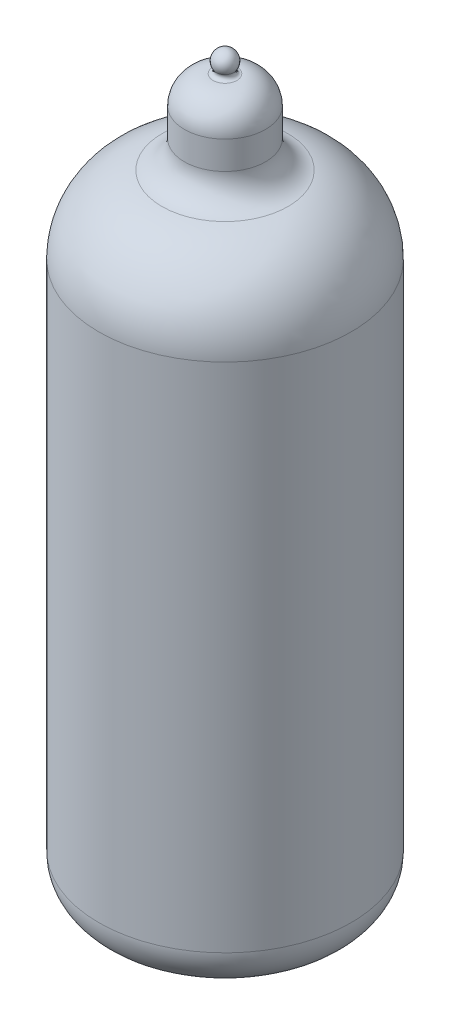
ISO-10303-21;
HEADER;
FILE_DESCRIPTION(('STEP AP214'),'2;1');
FILE_NAME('part.step','',(''),(''),'','','');
FILE_SCHEMA(('AUTOMOTIVE_DESIGN { 1 0 10303 214 1 1 1 1 }'));
ENDSEC;
DATA;
#1=APPLICATION_CONTEXT('core data for automotive mechanical design processes');
#2=APPLICATION_PROTOCOL_DEFINITION('international standard','automotive_design',2000,#1);
#3=PRODUCT_CONTEXT('',#1,'mechanical');
#4=PRODUCT('Part','Part','',(#3));
#5=PRODUCT_RELATED_PRODUCT_CATEGORY('part','',(#4));
#6=PRODUCT_DEFINITION_FORMATION('','',#4);
#7=PRODUCT_DEFINITION_CONTEXT('part definition',#1,'design');
#8=PRODUCT_DEFINITION('design','',#6,#7);
#9=PRODUCT_DEFINITION_SHAPE('','',#8);
#10=(LENGTH_UNIT() NAMED_UNIT(*) SI_UNIT(.MILLI.,.METRE.));
#11=(NAMED_UNIT(*) PLANE_ANGLE_UNIT() SI_UNIT($,.RADIAN.));
#12=(NAMED_UNIT(*) SI_UNIT($,.STERADIAN.) SOLID_ANGLE_UNIT());
#13=UNCERTAINTY_MEASURE_WITH_UNIT(LENGTH_MEASURE(1.E-05),#10,'distance_accuracy_value','');
#14=(GEOMETRIC_REPRESENTATION_CONTEXT(3) GLOBAL_UNCERTAINTY_ASSIGNED_CONTEXT((#13)) GLOBAL_UNIT_ASSIGNED_CONTEXT((#10,
#11,#12)) REPRESENTATION_CONTEXT('',''));
#15=CARTESIAN_POINT('',(0.,0.,0.));
#16=DIRECTION('',(0.,0.,1.));
#17=DIRECTION('',(1.,0.,0.));
#18=AXIS2_PLACEMENT_3D('',#15,#16,#17);
#19=CARTESIAN_POINT('',(-0.896039603960396,24.210396039604,0.));
#20=DIRECTION('',(0.,-1.,0.));
#21=DIRECTION('',(0.,0.,-1.));
#22=AXIS2_PLACEMENT_3D('',#19,#20,#21);
#23=PLANE('',#22);
#24=CARTESIAN_POINT('',(0.,24.210396039604,0.));
#25=DIRECTION('',(0.,1.,0.));
#26=DIRECTION('',(0.,0.,1.));
#27=AXIS2_PLACEMENT_3D('',#24,#25,#26);
#28=CIRCLE('',#27,0.896039603960402);
#29=CARTESIAN_POINT('',(0.,24.210396039604,0.896039603960402));
#30=VERTEX_POINT('',#29);
#31=EDGE_CURVE('E11',#30,#30,#28,.T.);
#32=ORIENTED_EDGE('',*,*,#31,.F.);
#33=EDGE_LOOP('',(#32));
#34=FACE_BOUND('',#33,.T.);
#35=ADVANCED_FACE('F38',(#34),#23,.T.);
#36=CARTESIAN_POINT('',(0.,22.710396039604,0.));
#37=DIRECTION('',(0.,1.,0.));
#38=DIRECTION('',(0.,0.,1.));
#39=AXIS2_PLACEMENT_3D('',#36,#37,#38);
#40=DEGENERATE_TOROIDAL_SURFACE('',#39,0.896039603960402,1.5,.T.);
#41=ORIENTED_EDGE('',*,*,#31,.T.);
#42=EDGE_LOOP('',(#41));
#43=FACE_BOUND('',#42,.T.);
#44=CARTESIAN_POINT('',(0.,22.710396039604,0.));
#45=DIRECTION('',(0.,1.,0.));
#46=DIRECTION('',(0.,0.,1.));
#47=AXIS2_PLACEMENT_3D('',#44,#45,#46);
#48=CIRCLE('',#47,2.3960396039604);
#49=CARTESIAN_POINT('',(0.,22.710396039604,2.3960396039604));
#50=VERTEX_POINT('',#49);
#51=EDGE_CURVE('E46',#50,#50,#48,.T.);
#52=ORIENTED_EDGE('',*,*,#51,.F.);
#53=EDGE_LOOP('',(#52));
#54=FACE_BOUND('',#53,.T.);
#55=ADVANCED_FACE('F314',(#43,#54),#40,.F.);
#56=CARTESIAN_POINT('',(0.,26.25,0.));
#57=DIRECTION('',(0.,1.,0.));
#58=DIRECTION('',(0.,0.,1.));
#59=AXIS2_PLACEMENT_3D('',#56,#57,#58);
#60=CYLINDRICAL_SURFACE('',#59,2.3960396039604);
#61=ORIENTED_EDGE('',*,*,#51,.T.);
#62=EDGE_LOOP('',(#61));
#63=FACE_BOUND('',#62,.T.);
#64=CARTESIAN_POINT('',(0.,20.710396039604,0.));
#65=DIRECTION('',(0.,1.,0.));
#66=DIRECTION('',(0.,0.,1.));
#67=AXIS2_PLACEMENT_3D('',#64,#65,#66);
#68=CIRCLE('',#67,2.3960396039604);
#69=CARTESIAN_POINT('',(0.,20.710396039604,2.3960396039604));
#70=VERTEX_POINT('',#69);
#71=EDGE_CURVE('E306',#70,#70,#68,.T.);
#72=ORIENTED_EDGE('',*,*,#71,.F.);
#73=EDGE_LOOP('',(#72));
#74=FACE_BOUND('',#73,.T.);
#75=ADVANCED_FACE('F311',(#63,#74),#60,.F.);
#76=CARTESIAN_POINT('',(0.,20.710396039604,0.));
#77=DIRECTION('',(0.,1.,0.));
#78=DIRECTION('',(0.,0.,1.));
#79=AXIS2_PLACEMENT_3D('',#76,#77,#78);
#80=TOROIDAL_SURFACE('',#79,4.8960396039604,2.5);
#81=ORIENTED_EDGE('',*,*,#71,.T.);
#82=EDGE_LOOP('',(#81));
#83=FACE_BOUND('',#82,.T.);
#84=CARTESIAN_POINT('',(0.,18.259900990099,0.));
#85=DIRECTION('',(0.,1.,0.));
#86=DIRECTION('',(0.,0.,1.));
#87=AXIS2_PLACEMENT_3D('',#84,#85,#86);
#88=CIRCLE('',#87,4.40099009900991);
#89=CARTESIAN_POINT('',(0.,18.259900990099,4.40099009900991));
#90=VERTEX_POINT('',#89);
#91=EDGE_CURVE('E303',#90,#90,#88,.T.);
#92=ORIENTED_EDGE('',*,*,#91,.F.);
#93=EDGE_LOOP('',(#92));
#94=FACE_BOUND('',#93,.T.);
#95=ADVANCED_FACE('F322',(#83,#94),#80,.T.);
#96=CARTESIAN_POINT('',(0.,13.25,0.));
#97=DIRECTION('',(0.,1.,0.));
#98=DIRECTION('',(0.,0.,1.));
#99=AXIS2_PLACEMENT_3D('',#96,#97,#98);
#100=DEGENERATE_TOROIDAL_SURFACE('',#99,3.38888888888889,5.11111111111111,.T.);
#101=ORIENTED_EDGE('',*,*,#91,.T.);
#102=EDGE_LOOP('',(#101));
#103=FACE_BOUND('',#102,.T.);
#104=CARTESIAN_POINT('',(0.,13.25,0.));
#105=DIRECTION('',(0.,1.,0.));
#106=DIRECTION('',(0.,0.,1.));
#107=AXIS2_PLACEMENT_3D('',#104,#105,#106);
#108=CIRCLE('',#107,8.5);
#109=CARTESIAN_POINT('',(0.,13.25,8.5));
#110=VERTEX_POINT('',#109);
#111=EDGE_CURVE('E300',#110,#110,#108,.T.);
#112=ORIENTED_EDGE('',*,*,#111,.F.);
#113=EDGE_LOOP('',(#112));
#114=FACE_BOUND('',#113,.T.);
#115=ADVANCED_FACE('F328',(#103,#114),#100,.F.);
#116=CARTESIAN_POINT('',(0.,26.25,0.));
#117=DIRECTION('',(0.,1.,0.));
#118=DIRECTION('',(0.,0.,1.));
#119=AXIS2_PLACEMENT_3D('',#116,#117,#118);
#120=CYLINDRICAL_SURFACE('',#119,8.5);
#121=ORIENTED_EDGE('',*,*,#111,.T.);
#122=EDGE_LOOP('',(#121));
#123=FACE_BOUND('',#122,.T.);
#124=CARTESIAN_POINT('',(0.,-21.25,0.));
#125=DIRECTION('',(0.,1.,0.));
#126=DIRECTION('',(0.,0.,1.));
#127=AXIS2_PLACEMENT_3D('',#124,#125,#126);
#128=CIRCLE('',#127,8.5);
#129=CARTESIAN_POINT('',(0.,-21.25,8.5));
#130=VERTEX_POINT('',#129);
#131=EDGE_CURVE('E297',#130,#130,#128,.T.);
#132=ORIENTED_EDGE('',*,*,#131,.F.);
#133=EDGE_LOOP('',(#132));
#134=FACE_BOUND('',#133,.T.);
#135=ADVANCED_FACE('F332',(#123,#134),#120,.F.);
#136=CARTESIAN_POINT('',(0.,-21.25,0.));
#137=DIRECTION('',(0.,1.,0.));
#138=DIRECTION('',(0.,0.,1.));
#139=AXIS2_PLACEMENT_3D('',#136,#137,#138);
#140=TOROIDAL_SURFACE('',#139,7.5,1.);
#141=ORIENTED_EDGE('',*,*,#131,.T.);
#142=EDGE_LOOP('',(#141));
#143=FACE_BOUND('',#142,.T.);
#144=CARTESIAN_POINT('',(0.,-22.25,0.));
#145=DIRECTION('',(0.,1.,0.));
#146=DIRECTION('',(0.,0.,1.));
#147=AXIS2_PLACEMENT_3D('',#144,#145,#146);
#148=CIRCLE('',#147,7.5);
#149=CARTESIAN_POINT('',(0.,-22.25,7.5));
#150=VERTEX_POINT('',#149);
#151=EDGE_CURVE('E293',#150,#150,#148,.T.);
#152=ORIENTED_EDGE('',*,*,#151,.F.);
#153=EDGE_LOOP('',(#152));
#154=FACE_BOUND('',#153,.T.);
#155=ADVANCED_FACE('F336',(#143,#154),#140,.F.);
#156=CARTESIAN_POINT('',(-7.49999999999999,-22.25,0.));
#157=DIRECTION('',(0.,1.,0.));
#158=DIRECTION('',(0.,0.,1.));
#159=AXIS2_PLACEMENT_3D('',#156,#157,#158);
#160=PLANE('',#159);
#161=CARTESIAN_POINT('',(2.67215823925168,-22.25,-5.09137214750595));
#162=DIRECTION('',(0.,1.,0.));
#163=DIRECTION('',(0.,0.,1.));
#164=AXIS2_PLACEMENT_3D('',#161,#162,#163);
#165=CIRCLE('',#164,0.25);
#166=CARTESIAN_POINT('',(2.67215823925168,-22.25,-4.84137214750595));
#167=VERTEX_POINT('',#166);
#168=EDGE_CURVE('E203',#167,#167,#165,.F.);
#169=ORIENTED_EDGE('',*,*,#168,.T.);
#170=EDGE_LOOP('',(#169));
#171=FACE_BOUND('',#170,.T.);
#172=CARTESIAN_POINT('',(4.73215722888853,-22.25,-3.26637229370414));
#173=DIRECTION('',(0.,1.,0.));
#174=DIRECTION('',(0.,0.,1.));
#175=AXIS2_PLACEMENT_3D('',#172,#173,#174);
#176=CIRCLE('',#175,0.25);
#177=CARTESIAN_POINT('',(4.73215722888853,-22.25,-3.01637229370414));
#178=VERTEX_POINT('',#177);
#179=EDGE_CURVE('E205',#178,#178,#176,.F.);
#180=ORIENTED_EDGE('',*,*,#179,.T.);
#181=EDGE_LOOP('',(#180));
#182=FACE_BOUND('',#181,.T.);
#183=CARTESIAN_POINT('',(5.70807602606381,-22.25,-0.693085911468095));
#184=DIRECTION('',(0.,1.,0.));
#185=DIRECTION('',(0.,0.,1.));
#186=AXIS2_PLACEMENT_3D('',#183,#184,#185);
#187=CIRCLE('',#186,0.25);
#188=CARTESIAN_POINT('',(5.70807602606381,-22.25,-0.443085911468095));
#189=VERTEX_POINT('',#188);
#190=EDGE_CURVE('E210',#189,#189,#187,.F.);
#191=ORIENTED_EDGE('',*,*,#190,.T.);
#192=EDGE_LOOP('',(#191));
#193=FACE_BOUND('',#192,.T.);
#194=CARTESIAN_POINT('',(5.37634339544113,-22.25,2.03897810049459));
#195=DIRECTION('',(0.,1.,0.));
#196=DIRECTION('',(0.,0.,1.));
#197=AXIS2_PLACEMENT_3D('',#194,#195,#196);
#198=CIRCLE('',#197,0.25);
#199=CARTESIAN_POINT('',(5.37634339544113,-22.25,2.28897810049459));
#200=VERTEX_POINT('',#199);
#201=EDGE_CURVE('E215',#200,#200,#198,.F.);
#202=ORIENTED_EDGE('',*,*,#201,.T.);
#203=EDGE_LOOP('',(#202));
#204=FACE_BOUND('',#203,.T.);
#205=CARTESIAN_POINT('',(3.81295528488456,-22.25,4.30393680198384));
#206=DIRECTION('',(0.,1.,0.));
#207=DIRECTION('',(0.,0.,1.));
#208=AXIS2_PLACEMENT_3D('',#205,#206,#207);
#209=CIRCLE('',#208,0.250000000000001);
#210=CARTESIAN_POINT('',(3.81295528488456,-22.25,4.55393680198384));
#211=VERTEX_POINT('',#210);
#212=EDGE_CURVE('E220',#211,#211,#209,.F.);
#213=ORIENTED_EDGE('',*,*,#212,.T.);
#214=EDGE_LOOP('',(#213));
#215=FACE_BOUND('',#214,.T.);
#216=CARTESIAN_POINT('',(1.37606506965345,-22.25,5.5829154501998));
#217=DIRECTION('',(0.,1.,0.));
#218=DIRECTION('',(0.,0.,1.));
#219=AXIS2_PLACEMENT_3D('',#216,#217,#218);
#220=CIRCLE('',#219,0.25);
#221=CARTESIAN_POINT('',(1.37606506965345,-22.25,5.8329154501998));
#222=VERTEX_POINT('',#221);
#223=EDGE_CURVE('E225',#222,#222,#220,.F.);
#224=ORIENTED_EDGE('',*,*,#223,.T.);
#225=EDGE_LOOP('',(#224));
#226=FACE_BOUND('',#225,.T.);
#227=CARTESIAN_POINT('',(-1.37606506965347,-22.25,5.5829154501998));
#228=DIRECTION('',(0.,1.,0.));
#229=DIRECTION('',(0.,0.,1.));
#230=AXIS2_PLACEMENT_3D('',#227,#228,#229);
#231=CIRCLE('',#230,0.25);
#232=CARTESIAN_POINT('',(-1.37606506965347,-22.25,5.8329154501998));
#233=VERTEX_POINT('',#232);
#234=EDGE_CURVE('E230',#233,#233,#231,.F.);
#235=ORIENTED_EDGE('',*,*,#234,.T.);
#236=EDGE_LOOP('',(#235));
#237=FACE_BOUND('',#236,.T.);
#238=CARTESIAN_POINT('',(-3.81295528488458,-22.25,4.30393680198382));
#239=DIRECTION('',(0.,1.,0.));
#240=DIRECTION('',(0.,0.,1.));
#241=AXIS2_PLACEMENT_3D('',#238,#239,#240);
#242=CIRCLE('',#241,0.25);
#243=CARTESIAN_POINT('',(-3.81295528488458,-22.25,4.55393680198382));
#244=VERTEX_POINT('',#243);
#245=EDGE_CURVE('E235',#244,#244,#242,.F.);
#246=ORIENTED_EDGE('',*,*,#245,.T.);
#247=EDGE_LOOP('',(#246));
#248=FACE_BOUND('',#247,.T.);
#249=CARTESIAN_POINT('',(-5.37634339544114,-22.25,2.03897810049457));
#250=DIRECTION('',(0.,1.,0.));
#251=DIRECTION('',(0.,0.,1.));
#252=AXIS2_PLACEMENT_3D('',#249,#250,#251);
#253=CIRCLE('',#252,0.25);
#254=CARTESIAN_POINT('',(-5.37634339544114,-22.25,2.28897810049457));
#255=VERTEX_POINT('',#254);
#256=EDGE_CURVE('E240',#255,#255,#253,.F.);
#257=ORIENTED_EDGE('',*,*,#256,.T.);
#258=EDGE_LOOP('',(#257));
#259=FACE_BOUND('',#258,.T.);
#260=CARTESIAN_POINT('',(-5.70807602606381,-22.25,-0.693085911468117));
#261=DIRECTION('',(0.,1.,0.));
#262=DIRECTION('',(0.,0.,1.));
#263=AXIS2_PLACEMENT_3D('',#260,#261,#262);
#264=CIRCLE('',#263,0.25);
#265=CARTESIAN_POINT('',(-5.70807602606381,-22.25,-0.443085911468116));
#266=VERTEX_POINT('',#265);
#267=EDGE_CURVE('E245',#266,#266,#264,.F.);
#268=ORIENTED_EDGE('',*,*,#267,.T.);
#269=EDGE_LOOP('',(#268));
#270=FACE_BOUND('',#269,.T.);
#271=CARTESIAN_POINT('',(-4.73215722888852,-22.25,-3.26637229370415));
#272=DIRECTION('',(0.,1.,0.));
#273=DIRECTION('',(0.,0.,1.));
#274=AXIS2_PLACEMENT_3D('',#271,#272,#273);
#275=CIRCLE('',#274,0.250000000000001);
#276=CARTESIAN_POINT('',(-4.73215722888852,-22.25,-3.01637229370415));
#277=VERTEX_POINT('',#276);
#278=EDGE_CURVE('E250',#277,#277,#275,.F.);
#279=ORIENTED_EDGE('',*,*,#278,.T.);
#280=EDGE_LOOP('',(#279));
#281=FACE_BOUND('',#280,.T.);
#282=CARTESIAN_POINT('',(-2.67215823925166,-22.25,-5.09137214750596));
#283=DIRECTION('',(0.,1.,0.));
#284=DIRECTION('',(0.,0.,1.));
#285=AXIS2_PLACEMENT_3D('',#282,#283,#284);
#286=CIRCLE('',#285,0.25);
#287=CARTESIAN_POINT('',(-2.67215823925166,-22.25,-4.84137214750596));
#288=VERTEX_POINT('',#287);
#289=EDGE_CURVE('E255',#288,#288,#286,.F.);
#290=ORIENTED_EDGE('',*,*,#289,.T.);
#291=EDGE_LOOP('',(#290));
#292=FACE_BOUND('',#291,.T.);
#293=CARTESIAN_POINT('',(0.,-22.25,-5.75));
#294=DIRECTION('',(0.,1.,0.));
#295=DIRECTION('',(0.,0.,1.));
#296=AXIS2_PLACEMENT_3D('',#293,#294,#295);
#297=CIRCLE('',#296,0.25);
#298=CARTESIAN_POINT('',(0.,-22.25,-5.5));
#299=VERTEX_POINT('',#298);
#300=EDGE_CURVE('E260',#299,#299,#297,.F.);
#301=ORIENTED_EDGE('',*,*,#300,.T.);
#302=EDGE_LOOP('',(#301));
#303=FACE_BOUND('',#302,.T.);
#304=ORIENTED_EDGE('',*,*,#151,.T.);
#305=EDGE_LOOP('',(#304));
#306=FACE_BOUND('',#305,.T.);
#307=ADVANCED_FACE('F340',(#171,#182,#193,#204,#215,#226,#237,#248,#259,#270,#281,#292,#303,
#306),#160,.T.);
#308=CARTESIAN_POINT('',(0.,26.251,-5.75));
#309=DIRECTION('',(0.,-1.,0.));
#310=DIRECTION('',(0.,0.,-1.));
#311=AXIS2_PLACEMENT_3D('',#308,#309,#310);
#312=CYLINDRICAL_SURFACE('',#311,0.25);
#313=ORIENTED_EDGE('',*,*,#300,.F.);
#314=EDGE_LOOP('',(#313));
#315=FACE_BOUND('',#314,.T.);
#316=CARTESIAN_POINT('',(0.,-26.25,-5.75));
#317=DIRECTION('',(0.,-1.,0.));
#318=DIRECTION('',(0.,0.,-1.));
#319=AXIS2_PLACEMENT_3D('',#316,#317,#318);
#320=CIRCLE('',#319,0.25);
#321=CARTESIAN_POINT('',(0.,-26.25,-6.));
#322=VERTEX_POINT('',#321);
#323=EDGE_CURVE('E263',#322,#322,#320,.T.);
#324=ORIENTED_EDGE('',*,*,#323,.T.);
#325=EDGE_LOOP('',(#324));
#326=FACE_BOUND('',#325,.T.);
#327=ADVANCED_FACE('F344',(#315,#326),#312,.F.);
#328=CARTESIAN_POINT('',(0.,25.5,0.));
#329=DIRECTION('',(0.,1.,0.));
#330=DIRECTION('',(1.,0.,0.));
#331=AXIS2_PLACEMENT_3D('',#328,#329,#330);
#332=SPHERICAL_SURFACE('',#331,0.750000000000001);
#333=CARTESIAN_POINT('',(0.,25.0948011010718,0.));
#334=DIRECTION('',(0.,1.,0.));
#335=DIRECTION('',(0.,0.,1.));
#336=AXIS2_PLACEMENT_3D('',#333,#334,#335);
#337=CIRCLE('',#336,0.631121107480484);
#338=CARTESIAN_POINT('',(0.,25.0948011010718,0.631121107480484));
#339=VERTEX_POINT('',#338);
#340=EDGE_CURVE('E266',#339,#339,#337,.T.);
#341=ORIENTED_EDGE('',*,*,#340,.T.);
#342=EDGE_LOOP('',(#341));
#343=FACE_BOUND('',#342,.T.);
#344=ADVANCED_FACE('F40',(#343),#332,.T.);
#345=CARTESIAN_POINT('',(0.,-26.25,0.));
#346=DIRECTION('',(0.,-1.,0.));
#347=DIRECTION('',(0.,0.,-1.));
#348=AXIS2_PLACEMENT_3D('',#345,#346,#347);
#349=PLANE('',#348);
#350=CARTESIAN_POINT('',(0.,-26.25,0.));
#351=DIRECTION('',(0.,-1.,0.));
#352=DIRECTION('',(0.,0.,-1.));
#353=AXIS2_PLACEMENT_3D('',#350,#351,#352);
#354=CIRCLE('',#353,3.);
#355=CARTESIAN_POINT('',(0.,-26.25,-3.));
#356=VERTEX_POINT('',#355);
#357=EDGE_CURVE('E170',#356,#356,#354,.T.);
#358=ORIENTED_EDGE('',*,*,#357,.F.);
#359=EDGE_LOOP('',(#358));
#360=FACE_BOUND('',#359,.T.);
#361=CARTESIAN_POINT('',(0.,-26.25,0.));
#362=DIRECTION('',(0.,1.,0.));
#363=DIRECTION('',(0.,0.,1.));
#364=AXIS2_PLACEMENT_3D('',#361,#362,#363);
#365=CIRCLE('',#364,6.);
#366=CARTESIAN_POINT('',(2.78833903226262,-26.25,-5.31273615391926));
#367=VERTEX_POINT('',#366);
#368=EDGE_CURVE('E289',#367,#322,#365,.T.);
#369=ORIENTED_EDGE('',*,*,#368,.F.);
#370=CARTESIAN_POINT('',(2.67215823925168,-26.25,-5.09137214750595));
#371=DIRECTION('',(0.,-1.,0.));
#372=DIRECTION('',(0.,0.,-1.));
#373=AXIS2_PLACEMENT_3D('',#370,#371,#372);
#374=CIRCLE('',#373,0.25);
#375=EDGE_CURVE('E59',#367,#367,#374,.T.);
#376=ORIENTED_EDGE('',*,*,#375,.F.);
#377=CARTESIAN_POINT('',(4.93790319536195,-26.25,-3.40838848038693));
#378=VERTEX_POINT('',#377);
#379=EDGE_CURVE('E475',#378,#367,#365,.T.);
#380=ORIENTED_EDGE('',*,*,#379,.F.);
#381=CARTESIAN_POINT('',(4.73215722888853,-26.25,-3.26637229370414));
#382=DIRECTION('',(0.,-1.,0.));
#383=DIRECTION('',(0.,0.,-1.));
#384=AXIS2_PLACEMENT_3D('',#381,#382,#383);
#385=CIRCLE('',#384,0.25);
#386=EDGE_CURVE('E208',#378,#378,#385,.T.);
#387=ORIENTED_EDGE('',*,*,#386,.F.);
#388=CARTESIAN_POINT('',(5.95625324458833,-26.25,-0.723220081531926));
#389=VERTEX_POINT('',#388);
#390=EDGE_CURVE('E480',#389,#378,#365,.T.);
#391=ORIENTED_EDGE('',*,*,#390,.F.);
#392=CARTESIAN_POINT('',(5.70807602606381,-26.25,-0.693085911468095));
#393=DIRECTION('',(0.,-1.,0.));
#394=DIRECTION('',(0.,0.,-1.));
#395=AXIS2_PLACEMENT_3D('',#392,#393,#394);
#396=CIRCLE('',#395,0.25);
#397=EDGE_CURVE('E213',#389,#389,#396,.T.);
#398=ORIENTED_EDGE('',*,*,#397,.F.);
#399=CARTESIAN_POINT('',(5.61009745611249,-26.25,2.12762932225523));
#400=VERTEX_POINT('',#399);
#401=EDGE_CURVE('E482',#400,#389,#365,.T.);
#402=ORIENTED_EDGE('',*,*,#401,.F.);
#403=CARTESIAN_POINT('',(5.37634339544113,-26.25,2.03897810049459));
#404=DIRECTION('',(0.,-1.,0.));
#405=DIRECTION('',(0.,0.,-1.));
#406=AXIS2_PLACEMENT_3D('',#403,#404,#405);
#407=CIRCLE('',#406,0.25);
#408=EDGE_CURVE('E218',#400,#400,#407,.T.);
#409=ORIENTED_EDGE('',*,*,#408,.F.);
#410=CARTESIAN_POINT('',(3.97873594944477,-26.25,4.49106448902662));
#411=VERTEX_POINT('',#410);
#412=EDGE_CURVE('E483',#411,#400,#365,.T.);
#413=ORIENTED_EDGE('',*,*,#412,.F.);
#414=CARTESIAN_POINT('',(3.81295528488456,-26.25,4.30393680198384));
#415=DIRECTION('',(0.,-1.,0.));
#416=DIRECTION('',(0.,0.,-1.));
#417=AXIS2_PLACEMENT_3D('',#414,#415,#416);
#418=CIRCLE('',#417,0.250000000000001);
#419=EDGE_CURVE('E223',#411,#411,#418,.T.);
#420=ORIENTED_EDGE('',*,*,#419,.F.);
#421=CARTESIAN_POINT('',(1.43589398572534,-26.25,5.82565090455632));
#422=VERTEX_POINT('',#421);
#423=EDGE_CURVE('E486',#422,#411,#365,.T.);
#424=ORIENTED_EDGE('',*,*,#423,.F.);
#425=CARTESIAN_POINT('',(1.37606506965345,-26.25,5.5829154501998));
#426=DIRECTION('',(0.,-1.,0.));
#427=DIRECTION('',(0.,0.,-1.));
#428=AXIS2_PLACEMENT_3D('',#425,#426,#427);
#429=CIRCLE('',#428,0.25);
#430=EDGE_CURVE('E228',#422,#422,#429,.T.);
#431=ORIENTED_EDGE('',*,*,#430,.F.);
#432=CARTESIAN_POINT('',(-1.43589398572536,-26.25,5.82565090455631));
#433=VERTEX_POINT('',#432);
#434=EDGE_CURVE('E489',#433,#422,#365,.T.);
#435=ORIENTED_EDGE('',*,*,#434,.F.);
#436=CARTESIAN_POINT('',(-1.37606506965347,-26.25,5.5829154501998));
#437=DIRECTION('',(0.,-1.,0.));
#438=DIRECTION('',(0.,0.,-1.));
#439=AXIS2_PLACEMENT_3D('',#436,#437,#438);
#440=CIRCLE('',#439,0.25);
#441=EDGE_CURVE('E233',#433,#433,#440,.T.);
#442=ORIENTED_EDGE('',*,*,#441,.F.);
#443=CARTESIAN_POINT('',(-3.97873594944478,-26.25,4.4910644890266));
#444=VERTEX_POINT('',#443);
#445=EDGE_CURVE('E492',#444,#433,#365,.T.);
#446=ORIENTED_EDGE('',*,*,#445,.F.);
#447=CARTESIAN_POINT('',(-3.81295528488458,-26.25,4.30393680198382));
#448=DIRECTION('',(0.,-1.,0.));
#449=DIRECTION('',(0.,0.,-1.));
#450=AXIS2_PLACEMENT_3D('',#447,#448,#449);
#451=CIRCLE('',#450,0.25);
#452=EDGE_CURVE('E238',#444,#444,#451,.T.);
#453=ORIENTED_EDGE('',*,*,#452,.F.);
#454=CARTESIAN_POINT('',(-5.61009745611249,-26.25,2.1276293222552));
#455=VERTEX_POINT('',#454);
#456=EDGE_CURVE('E495',#455,#444,#365,.T.);
#457=ORIENTED_EDGE('',*,*,#456,.F.);
#458=CARTESIAN_POINT('',(-5.37634339544114,-26.25,2.03897810049457));
#459=DIRECTION('',(0.,-1.,0.));
#460=DIRECTION('',(0.,0.,-1.));
#461=AXIS2_PLACEMENT_3D('',#458,#459,#460);
#462=CIRCLE('',#461,0.25);
#463=EDGE_CURVE('E243',#455,#455,#462,.T.);
#464=ORIENTED_EDGE('',*,*,#463,.F.);
#465=CARTESIAN_POINT('',(-5.95625324458832,-26.25,-0.723220081531947));
#466=VERTEX_POINT('',#465);
#467=EDGE_CURVE('E498',#466,#455,#365,.T.);
#468=ORIENTED_EDGE('',*,*,#467,.F.);
#469=CARTESIAN_POINT('',(-5.70807602606381,-26.25,-0.693085911468117));
#470=DIRECTION('',(0.,-1.,0.));
#471=DIRECTION('',(0.,0.,-1.));
#472=AXIS2_PLACEMENT_3D('',#469,#470,#471);
#473=CIRCLE('',#472,0.25);
#474=EDGE_CURVE('E248',#466,#466,#473,.T.);
#475=ORIENTED_EDGE('',*,*,#474,.F.);
#476=CARTESIAN_POINT('',(-4.93790319536193,-26.25,-3.40838848038694));
#477=VERTEX_POINT('',#476);
#478=EDGE_CURVE('E501',#477,#466,#365,.T.);
#479=ORIENTED_EDGE('',*,*,#478,.F.);
#480=CARTESIAN_POINT('',(-4.73215722888852,-26.25,-3.26637229370415));
#481=DIRECTION('',(0.,-1.,0.));
#482=DIRECTION('',(0.,0.,-1.));
#483=AXIS2_PLACEMENT_3D('',#480,#481,#482);
#484=CIRCLE('',#483,0.250000000000001);
#485=EDGE_CURVE('E253',#477,#477,#484,.T.);
#486=ORIENTED_EDGE('',*,*,#485,.F.);
#487=CARTESIAN_POINT('',(-2.7883390322626,-26.25,-5.31273615391926));
#488=VERTEX_POINT('',#487);
#489=EDGE_CURVE('E294',#488,#477,#365,.T.);
#490=ORIENTED_EDGE('',*,*,#489,.F.);
#491=CARTESIAN_POINT('',(-2.67215823925166,-26.25,-5.09137214750596));
#492=DIRECTION('',(0.,-1.,0.));
#493=DIRECTION('',(0.,0.,-1.));
#494=AXIS2_PLACEMENT_3D('',#491,#492,#493);
#495=CIRCLE('',#494,0.25);
#496=EDGE_CURVE('E258',#488,#488,#495,.T.);
#497=ORIENTED_EDGE('',*,*,#496,.F.);
#498=EDGE_CURVE('E290',#322,#488,#365,.T.);
#499=ORIENTED_EDGE('',*,*,#498,.F.);
#500=ORIENTED_EDGE('',*,*,#323,.F.);
#501=EDGE_LOOP('',(#369,#376,#380,#387,#391,#398,#402,#409,#413,#420,#424,#431,#435,#442,#446,
#453,#457,#464,#468,#475,#479,#486,#490,#497,#499,#500));
#502=FACE_BOUND('',#501,.T.);
#503=ADVANCED_FACE('F346',(#360,#502),#349,.T.);
#504=CARTESIAN_POINT('',(0.,-23.25,0.));
#505=DIRECTION('',(0.,1.,0.));
#506=DIRECTION('',(0.,0.,1.));
#507=AXIS2_PLACEMENT_3D('',#504,#505,#506);
#508=TOROIDAL_SURFACE('',#507,6.,3.);
#509=ORIENTED_EDGE('',*,*,#498,.T.);
#510=ORIENTED_EDGE('',*,*,#489,.T.);
#511=ORIENTED_EDGE('',*,*,#478,.T.);
#512=ORIENTED_EDGE('',*,*,#467,.T.);
#513=ORIENTED_EDGE('',*,*,#456,.T.);
#514=ORIENTED_EDGE('',*,*,#445,.T.);
#515=ORIENTED_EDGE('',*,*,#434,.T.);
#516=ORIENTED_EDGE('',*,*,#423,.T.);
#517=ORIENTED_EDGE('',*,*,#412,.T.);
#518=ORIENTED_EDGE('',*,*,#401,.T.);
#519=ORIENTED_EDGE('',*,*,#390,.T.);
#520=ORIENTED_EDGE('',*,*,#379,.T.);
#521=ORIENTED_EDGE('',*,*,#368,.T.);
#522=EDGE_LOOP('',(#509,#510,#511,#512,#513,#514,#515,#516,#517,#518,#519,#520,#521));
#523=FACE_BOUND('',#522,.T.);
#524=CARTESIAN_POINT('',(0.,-23.25,0.));
#525=DIRECTION('',(0.,1.,0.));
#526=DIRECTION('',(0.,0.,1.));
#527=AXIS2_PLACEMENT_3D('',#524,#525,#526);
#528=CIRCLE('',#527,9.);
#529=CARTESIAN_POINT('',(0.,-23.25,9.));
#530=VERTEX_POINT('',#529);
#531=EDGE_CURVE('E286',#530,#530,#528,.T.);
#532=ORIENTED_EDGE('',*,*,#531,.F.);
#533=EDGE_LOOP('',(#532));
#534=FACE_BOUND('',#533,.T.);
#535=ADVANCED_FACE('F349',(#523,#534),#508,.T.);
#536=CARTESIAN_POINT('',(0.,26.25,0.));
#537=DIRECTION('',(0.,1.,0.));
#538=DIRECTION('',(0.,0.,1.));
#539=AXIS2_PLACEMENT_3D('',#536,#537,#538);
#540=CYLINDRICAL_SURFACE('',#539,9.);
#541=ORIENTED_EDGE('',*,*,#531,.T.);
#542=EDGE_LOOP('',(#541));
#543=FACE_BOUND('',#542,.T.);
#544=CARTESIAN_POINT('',(0.,13.25,0.));
#545=DIRECTION('',(0.,1.,0.));
#546=DIRECTION('',(0.,0.,1.));
#547=AXIS2_PLACEMENT_3D('',#544,#545,#546);
#548=CIRCLE('',#547,9.);
#549=CARTESIAN_POINT('',(0.,13.25,9.));
#550=VERTEX_POINT('',#549);
#551=EDGE_CURVE('E283',#550,#550,#548,.T.);
#552=ORIENTED_EDGE('',*,*,#551,.F.);
#553=EDGE_LOOP('',(#552));
#554=FACE_BOUND('',#553,.T.);
#555=ADVANCED_FACE('F353',(#543,#554),#540,.T.);
#556=CARTESIAN_POINT('',(0.,13.25,0.));
#557=DIRECTION('',(0.,1.,0.));
#558=DIRECTION('',(0.,0.,1.));
#559=AXIS2_PLACEMENT_3D('',#556,#557,#558);
#560=DEGENERATE_TOROIDAL_SURFACE('',#559,3.38888888888889,5.61111111111111,.T.);
#561=ORIENTED_EDGE('',*,*,#551,.T.);
#562=EDGE_LOOP('',(#561));
#563=FACE_BOUND('',#562,.T.);
#564=CARTESIAN_POINT('',(0.,18.75,0.));
#565=DIRECTION('',(0.,1.,0.));
#566=DIRECTION('',(0.,0.,1.));
#567=AXIS2_PLACEMENT_3D('',#564,#565,#566);
#568=CIRCLE('',#567,4.5);
#569=CARTESIAN_POINT('',(0.,18.75,4.5));
#570=VERTEX_POINT('',#569);
#571=EDGE_CURVE('E280',#570,#570,#568,.T.);
#572=ORIENTED_EDGE('',*,*,#571,.F.);
#573=EDGE_LOOP('',(#572));
#574=FACE_BOUND('',#573,.T.);
#575=ADVANCED_FACE('F357',(#563,#574),#560,.T.);
#576=CARTESIAN_POINT('',(0.,20.710396039604,0.));
#577=DIRECTION('',(0.,1.,0.));
#578=DIRECTION('',(0.,0.,1.));
#579=AXIS2_PLACEMENT_3D('',#576,#577,#578);
#580=TOROIDAL_SURFACE('',#579,4.8960396039604,2.);
#581=ORIENTED_EDGE('',*,*,#571,.T.);
#582=EDGE_LOOP('',(#581));
#583=FACE_BOUND('',#582,.T.);
#584=CARTESIAN_POINT('',(0.,20.710396039604,0.));
#585=DIRECTION('',(0.,1.,0.));
#586=DIRECTION('',(0.,0.,1.));
#587=AXIS2_PLACEMENT_3D('',#584,#585,#586);
#588=CIRCLE('',#587,2.8960396039604);
#589=CARTESIAN_POINT('',(0.,20.710396039604,2.8960396039604));
#590=VERTEX_POINT('',#589);
#591=EDGE_CURVE('E277',#590,#590,#588,.T.);
#592=ORIENTED_EDGE('',*,*,#591,.F.);
#593=EDGE_LOOP('',(#592));
#594=FACE_BOUND('',#593,.T.);
#595=ADVANCED_FACE('F361',(#583,#594),#580,.F.);
#596=CARTESIAN_POINT('',(0.,26.25,0.));
#597=DIRECTION('',(0.,1.,0.));
#598=DIRECTION('',(0.,0.,1.));
#599=AXIS2_PLACEMENT_3D('',#596,#597,#598);
#600=CYLINDRICAL_SURFACE('',#599,2.8960396039604);
#601=ORIENTED_EDGE('',*,*,#591,.T.);
#602=EDGE_LOOP('',(#601));
#603=FACE_BOUND('',#602,.T.);
#604=CARTESIAN_POINT('',(0.,22.710396039604,0.));
#605=DIRECTION('',(0.,1.,0.));
#606=DIRECTION('',(0.,0.,1.));
#607=AXIS2_PLACEMENT_3D('',#604,#605,#606);
#608=CIRCLE('',#607,2.8960396039604);
#609=CARTESIAN_POINT('',(0.,22.710396039604,2.8960396039604));
#610=VERTEX_POINT('',#609);
#611=EDGE_CURVE('E274',#610,#610,#608,.T.);
#612=ORIENTED_EDGE('',*,*,#611,.F.);
#613=EDGE_LOOP('',(#612));
#614=FACE_BOUND('',#613,.T.);
#615=ADVANCED_FACE('F365',(#603,#614),#600,.T.);
#616=CARTESIAN_POINT('',(0.,22.710396039604,0.));
#617=DIRECTION('',(0.,1.,0.));
#618=DIRECTION('',(0.,0.,1.));
#619=AXIS2_PLACEMENT_3D('',#616,#617,#618);
#620=DEGENERATE_TOROIDAL_SURFACE('',#619,0.896039603960402,2.,.T.);
#621=ORIENTED_EDGE('',*,*,#611,.T.);
#622=EDGE_LOOP('',(#621));
#623=FACE_BOUND('',#622,.T.);
#624=CARTESIAN_POINT('',(0.,24.7098082723374,0.));
#625=DIRECTION('',(0.,1.,0.));
#626=DIRECTION('',(0.,0.,1.));
#627=AXIS2_PLACEMENT_3D('',#624,#625,#626);
#628=CIRCLE('',#627,0.847555342639136);
#629=CARTESIAN_POINT('',(0.,24.7098082723374,0.847555342639136));
#630=VERTEX_POINT('',#629);
#631=EDGE_CURVE('E271',#630,#630,#628,.T.);
#632=ORIENTED_EDGE('',*,*,#631,.F.);
#633=EDGE_LOOP('',(#632));
#634=FACE_BOUND('',#633,.T.);
#635=ADVANCED_FACE('F369',(#623,#634),#620,.T.);
#636=CARTESIAN_POINT('',(0.,24.9597348014291,0.));
#637=DIRECTION('',(0.,1.,0.));
#638=DIRECTION('',(0.,0.,1.));
#639=AXIS2_PLACEMENT_3D('',#636,#637,#638);
#640=TOROIDAL_SURFACE('',#639,0.841494809973977,0.25);
#641=ORIENTED_EDGE('',*,*,#631,.T.);
#642=EDGE_LOOP('',(#641));
#643=FACE_BOUND('',#642,.T.);
#644=ORIENTED_EDGE('',*,*,#340,.F.);
#645=EDGE_LOOP('',(#644));
#646=FACE_BOUND('',#645,.T.);
#647=ADVANCED_FACE('F373',(#643,#646),#640,.F.);
#648=CARTESIAN_POINT('',(-2.67215823925166,26.251,-5.09137214750596));
#649=DIRECTION('',(0.,-1.,0.));
#650=DIRECTION('',(0.,0.,-1.));
#651=AXIS2_PLACEMENT_3D('',#648,#649,#650);
#652=CYLINDRICAL_SURFACE('',#651,0.25);
#653=ORIENTED_EDGE('',*,*,#289,.F.);
#654=EDGE_LOOP('',(#653));
#655=FACE_BOUND('',#654,.T.);
#656=ORIENTED_EDGE('',*,*,#496,.T.);
#657=EDGE_LOOP('',(#656));
#658=FACE_BOUND('',#657,.T.);
#659=ADVANCED_FACE('F377',(#655,#658),#652,.F.);
#660=CARTESIAN_POINT('',(-4.73215722888852,26.251,-3.26637229370415));
#661=DIRECTION('',(0.,-1.,0.));
#662=DIRECTION('',(0.,0.,-1.));
#663=AXIS2_PLACEMENT_3D('',#660,#661,#662);
#664=CYLINDRICAL_SURFACE('',#663,0.250000000000001);
#665=ORIENTED_EDGE('',*,*,#278,.F.);
#666=EDGE_LOOP('',(#665));
#667=FACE_BOUND('',#666,.T.);
#668=ORIENTED_EDGE('',*,*,#485,.T.);
#669=EDGE_LOOP('',(#668));
#670=FACE_BOUND('',#669,.T.);
#671=ADVANCED_FACE('F384',(#667,#670),#664,.F.);
#672=CARTESIAN_POINT('',(-5.70807602606381,26.251,-0.693085911468117));
#673=DIRECTION('',(0.,-1.,0.));
#674=DIRECTION('',(0.,0.,-1.));
#675=AXIS2_PLACEMENT_3D('',#672,#673,#674);
#676=CYLINDRICAL_SURFACE('',#675,0.25);
#677=ORIENTED_EDGE('',*,*,#267,.F.);
#678=EDGE_LOOP('',(#677));
#679=FACE_BOUND('',#678,.T.);
#680=ORIENTED_EDGE('',*,*,#474,.T.);
#681=EDGE_LOOP('',(#680));
#682=FACE_BOUND('',#681,.T.);
#683=ADVANCED_FACE('F388',(#679,#682),#676,.F.);
#684=CARTESIAN_POINT('',(-5.37634339544114,26.251,2.03897810049457));
#685=DIRECTION('',(0.,-1.,0.));
#686=DIRECTION('',(0.,0.,-1.));
#687=AXIS2_PLACEMENT_3D('',#684,#685,#686);
#688=CYLINDRICAL_SURFACE('',#687,0.25);
#689=ORIENTED_EDGE('',*,*,#256,.F.);
#690=EDGE_LOOP('',(#689));
#691=FACE_BOUND('',#690,.T.);
#692=ORIENTED_EDGE('',*,*,#463,.T.);
#693=EDGE_LOOP('',(#692));
#694=FACE_BOUND('',#693,.T.);
#695=ADVANCED_FACE('F392',(#691,#694),#688,.F.);
#696=CARTESIAN_POINT('',(-3.81295528488458,26.251,4.30393680198382));
#697=DIRECTION('',(0.,-1.,0.));
#698=DIRECTION('',(0.,0.,-1.));
#699=AXIS2_PLACEMENT_3D('',#696,#697,#698);
#700=CYLINDRICAL_SURFACE('',#699,0.25);
#701=ORIENTED_EDGE('',*,*,#245,.F.);
#702=EDGE_LOOP('',(#701));
#703=FACE_BOUND('',#702,.T.);
#704=ORIENTED_EDGE('',*,*,#452,.T.);
#705=EDGE_LOOP('',(#704));
#706=FACE_BOUND('',#705,.T.);
#707=ADVANCED_FACE('F396',(#703,#706),#700,.F.);
#708=CARTESIAN_POINT('',(-1.37606506965347,26.251,5.5829154501998));
#709=DIRECTION('',(0.,-1.,0.));
#710=DIRECTION('',(0.,0.,-1.));
#711=AXIS2_PLACEMENT_3D('',#708,#709,#710);
#712=CYLINDRICAL_SURFACE('',#711,0.25);
#713=ORIENTED_EDGE('',*,*,#234,.F.);
#714=EDGE_LOOP('',(#713));
#715=FACE_BOUND('',#714,.T.);
#716=ORIENTED_EDGE('',*,*,#441,.T.);
#717=EDGE_LOOP('',(#716));
#718=FACE_BOUND('',#717,.T.);
#719=ADVANCED_FACE('F400',(#715,#718),#712,.F.);
#720=CARTESIAN_POINT('',(1.37606506965345,26.251,5.5829154501998));
#721=DIRECTION('',(0.,-1.,0.));
#722=DIRECTION('',(0.,0.,-1.));
#723=AXIS2_PLACEMENT_3D('',#720,#721,#722);
#724=CYLINDRICAL_SURFACE('',#723,0.25);
#725=ORIENTED_EDGE('',*,*,#223,.F.);
#726=EDGE_LOOP('',(#725));
#727=FACE_BOUND('',#726,.T.);
#728=ORIENTED_EDGE('',*,*,#430,.T.);
#729=EDGE_LOOP('',(#728));
#730=FACE_BOUND('',#729,.T.);
#731=ADVANCED_FACE('F404',(#727,#730),#724,.F.);
#732=CARTESIAN_POINT('',(3.81295528488456,26.251,4.30393680198384));
#733=DIRECTION('',(0.,-1.,0.));
#734=DIRECTION('',(0.,0.,-1.));
#735=AXIS2_PLACEMENT_3D('',#732,#733,#734);
#736=CYLINDRICAL_SURFACE('',#735,0.250000000000001);
#737=ORIENTED_EDGE('',*,*,#212,.F.);
#738=EDGE_LOOP('',(#737));
#739=FACE_BOUND('',#738,.T.);
#740=ORIENTED_EDGE('',*,*,#419,.T.);
#741=EDGE_LOOP('',(#740));
#742=FACE_BOUND('',#741,.T.);
#743=ADVANCED_FACE('F408',(#739,#742),#736,.F.);
#744=CARTESIAN_POINT('',(5.37634339544113,26.251,2.03897810049459));
#745=DIRECTION('',(0.,-1.,0.));
#746=DIRECTION('',(0.,0.,-1.));
#747=AXIS2_PLACEMENT_3D('',#744,#745,#746);
#748=CYLINDRICAL_SURFACE('',#747,0.25);
#749=ORIENTED_EDGE('',*,*,#201,.F.);
#750=EDGE_LOOP('',(#749));
#751=FACE_BOUND('',#750,.T.);
#752=ORIENTED_EDGE('',*,*,#408,.T.);
#753=EDGE_LOOP('',(#752));
#754=FACE_BOUND('',#753,.T.);
#755=ADVANCED_FACE('F412',(#751,#754),#748,.F.);
#756=CARTESIAN_POINT('',(5.70807602606381,26.251,-0.693085911468095));
#757=DIRECTION('',(0.,-1.,0.));
#758=DIRECTION('',(0.,0.,-1.));
#759=AXIS2_PLACEMENT_3D('',#756,#757,#758);
#760=CYLINDRICAL_SURFACE('',#759,0.25);
#761=ORIENTED_EDGE('',*,*,#190,.F.);
#762=EDGE_LOOP('',(#761));
#763=FACE_BOUND('',#762,.T.);
#764=ORIENTED_EDGE('',*,*,#397,.T.);
#765=EDGE_LOOP('',(#764));
#766=FACE_BOUND('',#765,.T.);
#767=ADVANCED_FACE('F416',(#763,#766),#760,.F.);
#768=CARTESIAN_POINT('',(4.73215722888853,26.251,-3.26637229370414));
#769=DIRECTION('',(0.,-1.,0.));
#770=DIRECTION('',(0.,0.,-1.));
#771=AXIS2_PLACEMENT_3D('',#768,#769,#770);
#772=CYLINDRICAL_SURFACE('',#771,0.25);
#773=ORIENTED_EDGE('',*,*,#179,.F.);
#774=EDGE_LOOP('',(#773));
#775=FACE_BOUND('',#774,.T.);
#776=ORIENTED_EDGE('',*,*,#386,.T.);
#777=EDGE_LOOP('',(#776));
#778=FACE_BOUND('',#777,.T.);
#779=ADVANCED_FACE('F420',(#775,#778),#772,.F.);
#780=CARTESIAN_POINT('',(2.67215823925168,26.251,-5.09137214750595));
#781=DIRECTION('',(0.,-1.,0.));
#782=DIRECTION('',(0.,0.,-1.));
#783=AXIS2_PLACEMENT_3D('',#780,#781,#782);
#784=CYLINDRICAL_SURFACE('',#783,0.25);
#785=ORIENTED_EDGE('',*,*,#168,.F.);
#786=EDGE_LOOP('',(#785));
#787=FACE_BOUND('',#786,.T.);
#788=ORIENTED_EDGE('',*,*,#375,.T.);
#789=EDGE_LOOP('',(#788));
#790=FACE_BOUND('',#789,.T.);
#791=ADVANCED_FACE('F424',(#787,#790),#784,.F.);
#792=CARTESIAN_POINT('',(0.,-26.25,0.));
#793=DIRECTION('',(0.,-1.,0.));
#794=DIRECTION('',(0.,0.,-1.));
#795=AXIS2_PLACEMENT_3D('',#792,#793,#794);
#796=CONICAL_SURFACE('',#795,3.,0.261799387799149);
#797=CARTESIAN_POINT('',(0.,-25.75,0.));
#798=DIRECTION('',(0.,-1.,0.));
#799=DIRECTION('',(0.,0.,-1.));
#800=AXIS2_PLACEMENT_3D('',#797,#798,#799);
#801=CIRCLE('',#800,2.86602540378444);
#802=CARTESIAN_POINT('',(0.,-25.75,-2.86602540378444));
#803=VERTEX_POINT('',#802);
#804=EDGE_CURVE('E173',#803,#803,#801,.T.);
#805=ORIENTED_EDGE('',*,*,#804,.F.);
#806=EDGE_LOOP('',(#805));
#807=FACE_BOUND('',#806,.T.);
#808=ORIENTED_EDGE('',*,*,#357,.T.);
#809=EDGE_LOOP('',(#808));
#810=FACE_BOUND('',#809,.T.);
#811=ADVANCED_FACE('F428',(#807,#810),#796,.F.);
#812=CARTESIAN_POINT('',(0.,-25.75,0.));
#813=DIRECTION('',(0.,-1.,0.));
#814=DIRECTION('',(0.,0.,-1.));
#815=AXIS2_PLACEMENT_3D('',#812,#813,#814);
#816=PLANE('',#815);
#817=DIRECTION('',(1.,0.,0.));
#818=VECTOR('',#817,1.);
#819=CARTESIAN_POINT('',(0.,-25.75,2.63397459621556));
#820=LINE('',#819,#818);
#821=CARTESIAN_POINT('',(0.508974596215562,-25.75,2.63397459621556));
#822=VERTEX_POINT('',#821);
#823=CARTESIAN_POINT('',(-0.508974596215562,-25.75,2.63397459621556));
#824=VERTEX_POINT('',#823);
#825=EDGE_CURVE('E177',#822,#824,#820,.F.);
#826=ORIENTED_EDGE('',*,*,#825,.F.);
#827=DIRECTION('',(0.,0.,-1.));
#828=VECTOR('',#827,1.);
#829=CARTESIAN_POINT('',(0.508974596215562,-25.75,0.));
#830=LINE('',#829,#828);
#831=CARTESIAN_POINT('',(0.508974596215562,-25.75,-0.616025403784438));
#832=VERTEX_POINT('',#831);
#833=EDGE_CURVE('E196',#832,#822,#830,.F.);
#834=ORIENTED_EDGE('',*,*,#833,.F.);
#835=DIRECTION('',(1.,0.,0.));
#836=VECTOR('',#835,1.);
#837=CARTESIAN_POINT('',(0.,-25.75,-0.616025403784438));
#838=LINE('',#837,#836);
#839=CARTESIAN_POINT('',(0.953177702196305,-25.75,-0.616025403784438));
#840=VERTEX_POINT('',#839);
#841=EDGE_CURVE('E193',#840,#832,#838,.F.);
#842=ORIENTED_EDGE('',*,*,#841,.F.);
#843=DIRECTION('',(-0.393919298579168,0.,-0.919145030018058));
#844=VECTOR('',#843,1.);
#845=CARTESIAN_POINT('',(1.02831449805331,-25.75,-0.44070621345142));
#846=LINE('',#845,#844);
#847=CARTESIAN_POINT('',(0.,-25.75,-2.84010670890915));
#848=VERTEX_POINT('',#847);
#849=EDGE_CURVE('E191',#848,#840,#846,.F.);
#850=ORIENTED_EDGE('',*,*,#849,.F.);
#851=DIRECTION('',(-0.393919298579168,0.,0.919145030018058));
#852=VECTOR('',#851,1.);
#853=CARTESIAN_POINT('',(-1.02831449805331,-25.75,-0.44070621345142));
#854=LINE('',#853,#852);
#855=CARTESIAN_POINT('',(-0.953177702196305,-25.75,-0.616025403784438));
#856=VERTEX_POINT('',#855);
#857=EDGE_CURVE('E137',#856,#848,#854,.F.);
#858=ORIENTED_EDGE('',*,*,#857,.F.);
#859=DIRECTION('',(1.,0.,0.));
#860=VECTOR('',#859,1.);
#861=CARTESIAN_POINT('',(0.,-25.75,-0.616025403784438));
#862=LINE('',#861,#860);
#863=CARTESIAN_POINT('',(-0.508974596215561,-25.75,-0.616025403784438));
#864=VERTEX_POINT('',#863);
#865=EDGE_CURVE('E187',#864,#856,#862,.F.);
#866=ORIENTED_EDGE('',*,*,#865,.F.);
#867=DIRECTION('',(0.,0.,1.));
#868=VECTOR('',#867,1.);
#869=CARTESIAN_POINT('',(-0.508974596215562,-25.75,0.));
#870=LINE('',#869,#868);
#871=EDGE_CURVE('E169',#824,#864,#870,.F.);
#872=ORIENTED_EDGE('',*,*,#871,.F.);
#873=EDGE_LOOP('',(#826,#834,#842,#850,#858,#866,#872));
#874=FACE_BOUND('',#873,.T.);
#875=ORIENTED_EDGE('',*,*,#804,.T.);
#876=EDGE_LOOP('',(#875));
#877=FACE_BOUND('',#876,.T.);
#878=ADVANCED_FACE('F432',(#874,#877),#816,.T.);
#879=CARTESIAN_POINT('',(-0.375,-26.25,-0.749999999999999));
#880=DIRECTION('',(0.965925826289068,0.258819045102521,0.));
#881=DIRECTION('',(-0.258819045102521,0.965925826289068,0.));
#882=AXIS2_PLACEMENT_3D('',#879,#880,#881);
#883=PLANE('',#882);
#884=DIRECTION('',(0.,0.,-1.));
#885=VECTOR('',#884,1.);
#886=CARTESIAN_POINT('',(-0.375,-26.25,-0.749999999999999));
#887=LINE('',#886,#885);
#888=CARTESIAN_POINT('',(-0.375,-26.25,2.5));
#889=VERTEX_POINT('',#888);
#890=CARTESIAN_POINT('',(-0.375,-26.25,-0.749999999999999));
#891=VERTEX_POINT('',#890);
#892=EDGE_CURVE('E159',#889,#891,#887,.T.);
#893=ORIENTED_EDGE('',*,*,#892,.F.);
#894=DIRECTION('',(0.250562807085732,-0.935113126531029,-0.250562807085732));
#895=VECTOR('',#894,1.);
#896=CARTESIAN_POINT('',(-0.327913709778989,-26.4257284274447,2.45291370977899));
#897=LINE('',#896,#895);
#898=EDGE_CURVE('E174',#824,#889,#897,.T.);
#899=ORIENTED_EDGE('',*,*,#898,.F.);
#900=ORIENTED_EDGE('',*,*,#871,.T.);
#901=DIRECTION('',(0.250562807085732,-0.935113126531029,-0.250562807085732));
#902=VECTOR('',#901,1.);
#903=CARTESIAN_POINT('',(-0.398543145110505,-26.1621357862776,-0.726456854889494));
#904=LINE('',#903,#902);
#905=EDGE_CURVE('E175',#864,#891,#904,.T.);
#906=ORIENTED_EDGE('',*,*,#905,.T.);
#907=EDGE_LOOP('',(#893,#899,#900,#906));
#908=FACE_BOUND('',#907,.T.);
#909=ADVANCED_FACE('F453',(#908),#883,.F.);
#910=CARTESIAN_POINT('',(0.375,-26.25,2.5));
#911=DIRECTION('',(0.,0.258819045102521,-0.965925826289068));
#912=DIRECTION('',(0.,0.965925826289068,0.258819045102521));
#913=AXIS2_PLACEMENT_3D('',#910,#911,#912);
#914=PLANE('',#913);
#915=DIRECTION('',(-1.,0.,0.));
#916=VECTOR('',#915,1.);
#917=CARTESIAN_POINT('',(0.375,-26.25,2.5));
#918=LINE('',#917,#916);
#919=CARTESIAN_POINT('',(0.375,-26.25,2.5));
#920=VERTEX_POINT('',#919);
#921=EDGE_CURVE('E167',#920,#889,#918,.T.);
#922=ORIENTED_EDGE('',*,*,#921,.F.);
#923=DIRECTION('',(-0.250562807085732,-0.935113126531029,-0.250562807085732));
#924=VECTOR('',#923,1.);
#925=CARTESIAN_POINT('',(0.170959409042285,-27.0114898522606,2.29595940904229));
#926=LINE('',#925,#924);
#927=EDGE_CURVE('E179',#822,#920,#926,.T.);
#928=ORIENTED_EDGE('',*,*,#927,.F.);
#929=ORIENTED_EDGE('',*,*,#825,.T.);
#930=ORIENTED_EDGE('',*,*,#898,.T.);
#931=EDGE_LOOP('',(#922,#928,#929,#930));
#932=FACE_BOUND('',#931,.T.);
#933=ADVANCED_FACE('F449',(#932),#914,.F.);
#934=CARTESIAN_POINT('',(0.375,-26.25,-0.749999999999999));
#935=DIRECTION('',(-0.965925826289068,0.258819045102521,0.));
#936=DIRECTION('',(-0.258819045102521,-0.965925826289068,0.));
#937=AXIS2_PLACEMENT_3D('',#934,#935,#936);
#938=PLANE('',#937);
#939=DIRECTION('',(0.,0.,1.));
#940=VECTOR('',#939,1.);
#941=CARTESIAN_POINT('',(0.375,-26.25,-0.749999999999999));
#942=LINE('',#941,#940);
#943=CARTESIAN_POINT('',(0.375,-26.25,-0.749999999999999));
#944=VERTEX_POINT('',#943);
#945=EDGE_CURVE('E164',#944,#920,#942,.T.);
#946=ORIENTED_EDGE('',*,*,#945,.F.);
#947=DIRECTION('',(-0.250562807085732,-0.935113126531029,-0.250562807085732));
#948=VECTOR('',#947,1.);
#949=CARTESIAN_POINT('',(0.375,-26.25,-0.749999999999999));
#950=LINE('',#949,#948);
#951=EDGE_CURVE('E181',#832,#944,#950,.T.);
#952=ORIENTED_EDGE('',*,*,#951,.F.);
#953=ORIENTED_EDGE('',*,*,#833,.T.);
#954=ORIENTED_EDGE('',*,*,#927,.T.);
#955=EDGE_LOOP('',(#946,#952,#953,#954));
#956=FACE_BOUND('',#955,.T.);
#957=ADVANCED_FACE('F445',(#956),#938,.F.);
#958=CARTESIAN_POINT('',(0.75,-26.25,-0.749999999999999));
#959=DIRECTION('',(0.,0.258819045102521,-0.965925826289068));
#960=DIRECTION('',(0.,0.965925826289068,0.258819045102521));
#961=AXIS2_PLACEMENT_3D('',#958,#959,#960);
#962=PLANE('',#961);
#963=DIRECTION('',(-1.,0.,0.));
#964=VECTOR('',#963,1.);
#965=CARTESIAN_POINT('',(0.75,-26.25,-0.749999999999999));
#966=LINE('',#965,#964);
#967=CARTESIAN_POINT('',(0.75,-26.25,-0.749999999999999));
#968=VERTEX_POINT('',#967);
#969=EDGE_CURVE('E150',#968,#944,#966,.T.);
#970=ORIENTED_EDGE('',*,*,#969,.F.);
#971=DIRECTION('',(-0.365371756991174,-0.899143343589352,-0.240924732794587));
#972=VECTOR('',#971,1.);
#973=CARTESIAN_POINT('',(0.495830196778259,-26.8754864595726,-0.917598591719089));
#974=LINE('',#973,#972);
#975=EDGE_CURVE('E141',#840,#968,#974,.T.);
#976=ORIENTED_EDGE('',*,*,#975,.F.);
#977=ORIENTED_EDGE('',*,*,#841,.T.);
#978=ORIENTED_EDGE('',*,*,#951,.T.);
#979=EDGE_LOOP('',(#970,#976,#977,#978));
#980=FACE_BOUND('',#979,.T.);
#981=ADVANCED_FACE('F442',(#980),#962,.F.);
#982=CARTESIAN_POINT('',(0.,-26.25,-2.5));
#983=DIRECTION('',(-0.887825922599683,0.258819045102521,0.380496823971293));
#984=DIRECTION('',(0.393919298579168,0.,0.919145030018058));
#985=AXIS2_PLACEMENT_3D('',#982,#983,#984);
#986=PLANE('',#985);
#987=DIRECTION('',(0.393919298579168,0.,0.919145030018058));
#988=VECTOR('',#987,1.);
#989=CARTESIAN_POINT('',(0.,-26.25,-2.5));
#990=LINE('',#989,#988);
#991=CARTESIAN_POINT('',(0.,-26.25,-2.5));
#992=VERTEX_POINT('',#991);
#993=EDGE_CURVE('E145',#992,#968,#990,.T.);
#994=ORIENTED_EDGE('',*,*,#993,.F.);
#995=DIRECTION('',(0.,-0.826844439744778,0.562430682362852));
#996=VECTOR('',#995,1.);
#997=CARTESIAN_POINT('',(0.,-26.25,-2.5));
#998=LINE('',#997,#996);
#999=EDGE_CURVE('E134',#848,#992,#998,.T.);
#1000=ORIENTED_EDGE('',*,*,#999,.F.);
#1001=ORIENTED_EDGE('',*,*,#849,.T.);
#1002=ORIENTED_EDGE('',*,*,#975,.T.);
#1003=EDGE_LOOP('',(#994,#1000,#1001,#1002));
#1004=FACE_BOUND('',#1003,.T.);
#1005=ADVANCED_FACE('F146',(#1004),#986,.F.);
#1006=CARTESIAN_POINT('',(0.,-26.25,-2.5));
#1007=DIRECTION('',(0.887825922599683,0.258819045102521,0.380496823971293));
#1008=DIRECTION('',(0.393919298579168,0.,-0.919145030018058));
#1009=AXIS2_PLACEMENT_3D('',#1006,#1007,#1008);
#1010=PLANE('',#1009);
#1011=DIRECTION('',(0.393919298579168,0.,-0.919145030018058));
#1012=VECTOR('',#1011,1.);
#1013=CARTESIAN_POINT('',(0.,-26.25,-2.5));
#1014=LINE('',#1013,#1012);
#1015=CARTESIAN_POINT('',(-0.75,-26.25,-0.749999999999999));
#1016=VERTEX_POINT('',#1015);
#1017=EDGE_CURVE('E53',#1016,#992,#1014,.T.);
#1018=ORIENTED_EDGE('',*,*,#1017,.F.);
#1019=DIRECTION('',(0.365371756991174,-0.899143343589352,-0.240924732794586));
#1020=VECTOR('',#1019,1.);
#1021=CARTESIAN_POINT('',(-0.75,-26.25,-0.749999999999999));
#1022=LINE('',#1021,#1020);
#1023=EDGE_CURVE('E142',#856,#1016,#1022,.T.);
#1024=ORIENTED_EDGE('',*,*,#1023,.F.);
#1025=ORIENTED_EDGE('',*,*,#857,.T.);
#1026=ORIENTED_EDGE('',*,*,#999,.T.);
#1027=EDGE_LOOP('',(#1018,#1024,#1025,#1026));
#1028=FACE_BOUND('',#1027,.T.);
#1029=ADVANCED_FACE('F136',(#1028),#1010,.F.);
#1030=CARTESIAN_POINT('',(-0.75,-26.25,-0.749999999999999));
#1031=DIRECTION('',(0.,0.258819045102521,-0.965925826289068));
#1032=DIRECTION('',(0.,0.965925826289068,0.258819045102521));
#1033=AXIS2_PLACEMENT_3D('',#1030,#1031,#1032);
#1034=PLANE('',#1033);
#1035=DIRECTION('',(-1.,0.,0.));
#1036=VECTOR('',#1035,1.);
#1037=CARTESIAN_POINT('',(-0.75,-26.25,-0.749999999999999));
#1038=LINE('',#1037,#1036);
#1039=EDGE_CURVE('E157',#891,#1016,#1038,.T.);
#1040=ORIENTED_EDGE('',*,*,#1039,.F.);
#1041=ORIENTED_EDGE('',*,*,#905,.F.);
#1042=ORIENTED_EDGE('',*,*,#865,.T.);
#1043=ORIENTED_EDGE('',*,*,#1023,.T.);
#1044=EDGE_LOOP('',(#1040,#1041,#1042,#1043));
#1045=FACE_BOUND('',#1044,.T.);
#1046=ADVANCED_FACE('F434',(#1045),#1034,.F.);
#1047=ORIENTED_EDGE('',*,*,#921,.T.);
#1048=ORIENTED_EDGE('',*,*,#892,.T.);
#1049=ORIENTED_EDGE('',*,*,#1039,.T.);
#1050=ORIENTED_EDGE('',*,*,#1017,.T.);
#1051=ORIENTED_EDGE('',*,*,#993,.T.);
#1052=ORIENTED_EDGE('',*,*,#969,.T.);
#1053=ORIENTED_EDGE('',*,*,#945,.T.);
#1054=EDGE_LOOP('',(#1047,#1048,#1049,#1050,#1051,#1052,#1053));
#1055=FACE_BOUND('',#1054,.T.);
#1056=ADVANCED_FACE('F154',(#1055),#349,.T.);
#1057=CLOSED_SHELL('',(#35,#55,#75,#95,#115,#135,#155,#307,#327,#344,#503,#535,#555,#575,#595,
#615,#635,#647,#659,#671,#683,#695,#707,#719,#731,#743,#755,#767,#779,#791,#811,#878,#909,#933,
#957,#981,#1005,#1029,#1046,#1056));
#1058=MANIFOLD_SOLID_BREP('B2',#1057);
#1059=ADVANCED_BREP_SHAPE_REPRESENTATION('',(#18,#1058),#14);
#1060=SHAPE_DEFINITION_REPRESENTATION(#9,#1059);
ENDSEC;
END-ISO-10303-21;
